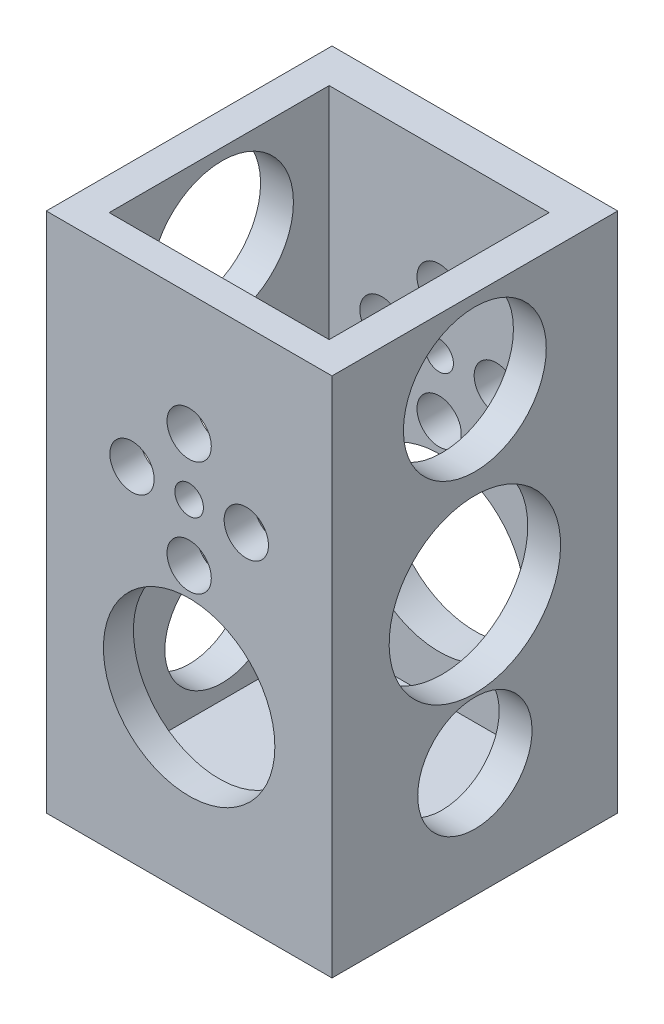
ISO-10303-21;
HEADER;
FILE_DESCRIPTION(('STEP AP214'),'2;1');
FILE_NAME('part.step','',(''),(''),'','','');
FILE_SCHEMA(('AUTOMOTIVE_DESIGN { 1 0 10303 214 1 1 1 1 }'));
ENDSEC;
DATA;
#1=APPLICATION_CONTEXT('core data for automotive mechanical design processes');
#2=APPLICATION_PROTOCOL_DEFINITION('international standard','automotive_design',2000,#1);
#3=PRODUCT_CONTEXT('',#1,'mechanical');
#4=PRODUCT('Part','Part','',(#3));
#5=PRODUCT_RELATED_PRODUCT_CATEGORY('part','',(#4));
#6=PRODUCT_DEFINITION_FORMATION('','',#4);
#7=PRODUCT_DEFINITION_CONTEXT('part definition',#1,'design');
#8=PRODUCT_DEFINITION('design','',#6,#7);
#9=PRODUCT_DEFINITION_SHAPE('','',#8);
#10=(LENGTH_UNIT() NAMED_UNIT(*) SI_UNIT(.MILLI.,.METRE.));
#11=(NAMED_UNIT(*) PLANE_ANGLE_UNIT() SI_UNIT($,.RADIAN.));
#12=(NAMED_UNIT(*) SI_UNIT($,.STERADIAN.) SOLID_ANGLE_UNIT());
#13=UNCERTAINTY_MEASURE_WITH_UNIT(LENGTH_MEASURE(1.E-05),#10,'distance_accuracy_value','');
#14=(GEOMETRIC_REPRESENTATION_CONTEXT(3) GLOBAL_UNCERTAINTY_ASSIGNED_CONTEXT((#13)) GLOBAL_UNIT_ASSIGNED_CONTEXT((#10,
#11,#12)) REPRESENTATION_CONTEXT('',''));
#15=CARTESIAN_POINT('',(0.,0.,0.));
#16=DIRECTION('',(0.,0.,1.));
#17=DIRECTION('',(1.,0.,0.));
#18=AXIS2_PLACEMENT_3D('',#15,#16,#17);
#19=CARTESIAN_POINT('',(0.,0.,20.));
#20=DIRECTION('',(0.,0.,-1.));
#21=DIRECTION('',(-1.,0.,0.));
#22=AXIS2_PLACEMENT_3D('',#19,#20,#21);
#23=CYLINDRICAL_SURFACE('',#22,1.);
#24=CARTESIAN_POINT('',(0.,0.,2.5));
#25=DIRECTION('',(0.,0.,-1.));
#26=DIRECTION('',(-1.,0.,0.));
#27=AXIS2_PLACEMENT_3D('',#24,#25,#26);
#28=CIRCLE('',#27,1.);
#29=CARTESIAN_POINT('',(-1.,0.,2.5));
#30=VERTEX_POINT('',#29);
#31=EDGE_CURVE('E177',#30,#30,#28,.T.);
#32=ORIENTED_EDGE('',*,*,#31,.F.);
#33=EDGE_LOOP('',(#32));
#34=FACE_BOUND('',#33,.T.);
#35=CARTESIAN_POINT('',(0.,0.,0.));
#36=DIRECTION('',(0.,0.,1.));
#37=DIRECTION('',(1.,0.,0.));
#38=AXIS2_PLACEMENT_3D('',#35,#36,#37);
#39=CIRCLE('',#38,1.);
#40=CARTESIAN_POINT('',(1.,0.,0.));
#41=VERTEX_POINT('',#40);
#42=EDGE_CURVE('E223',#41,#41,#39,.T.);
#43=ORIENTED_EDGE('',*,*,#42,.F.);
#44=EDGE_LOOP('',(#43));
#45=FACE_BOUND('',#44,.T.);
#46=ADVANCED_FACE('F36',(#34,#45),#23,.F.);
#47=CARTESIAN_POINT('',(0.,-11.9736496101837,20.));
#48=DIRECTION('',(0.,0.,-1.));
#49=DIRECTION('',(-1.,0.,0.));
#50=AXIS2_PLACEMENT_3D('',#47,#48,#49);
#51=CYLINDRICAL_SURFACE('',#50,6.);
#52=CARTESIAN_POINT('',(0.,-11.9736496101837,2.5));
#53=DIRECTION('',(0.,0.,-1.));
#54=DIRECTION('',(-1.,0.,0.));
#55=AXIS2_PLACEMENT_3D('',#52,#53,#54);
#56=CIRCLE('',#55,6.);
#57=CARTESIAN_POINT('',(-6.,-11.9736496101837,2.5));
#58=VERTEX_POINT('',#57);
#59=EDGE_CURVE('E174',#58,#58,#56,.T.);
#60=ORIENTED_EDGE('',*,*,#59,.F.);
#61=EDGE_LOOP('',(#60));
#62=FACE_BOUND('',#61,.T.);
#63=CARTESIAN_POINT('',(0.,-11.9736496101837,0.));
#64=DIRECTION('',(0.,0.,1.));
#65=DIRECTION('',(1.,0.,0.));
#66=AXIS2_PLACEMENT_3D('',#63,#64,#65);
#67=CIRCLE('',#66,6.);
#68=CARTESIAN_POINT('',(6.,-11.9736496101837,0.));
#69=VERTEX_POINT('',#68);
#70=EDGE_CURVE('E220',#69,#69,#67,.T.);
#71=ORIENTED_EDGE('',*,*,#70,.F.);
#72=EDGE_LOOP('',(#71));
#73=FACE_BOUND('',#72,.T.);
#74=ADVANCED_FACE('F314',(#62,#73),#51,.F.);
#75=CARTESIAN_POINT('',(0.,-4.,20.));
#76=DIRECTION('',(0.,0.,-1.));
#77=DIRECTION('',(-1.,0.,0.));
#78=AXIS2_PLACEMENT_3D('',#75,#76,#77);
#79=CYLINDRICAL_SURFACE('',#78,1.55);
#80=CARTESIAN_POINT('',(0.,-4.,2.5));
#81=DIRECTION('',(0.,0.,-1.));
#82=DIRECTION('',(-1.,0.,0.));
#83=AXIS2_PLACEMENT_3D('',#80,#81,#82);
#84=CIRCLE('',#83,1.55);
#85=CARTESIAN_POINT('',(-1.55,-4.,2.5));
#86=VERTEX_POINT('',#85);
#87=EDGE_CURVE('E171',#86,#86,#84,.T.);
#88=ORIENTED_EDGE('',*,*,#87,.F.);
#89=EDGE_LOOP('',(#88));
#90=FACE_BOUND('',#89,.T.);
#91=CARTESIAN_POINT('',(0.,-4.,0.));
#92=DIRECTION('',(0.,0.,1.));
#93=DIRECTION('',(1.,0.,0.));
#94=AXIS2_PLACEMENT_3D('',#91,#92,#93);
#95=CIRCLE('',#94,1.55);
#96=CARTESIAN_POINT('',(1.55,-4.,0.));
#97=VERTEX_POINT('',#96);
#98=EDGE_CURVE('E217',#97,#97,#95,.T.);
#99=ORIENTED_EDGE('',*,*,#98,.F.);
#100=EDGE_LOOP('',(#99));
#101=FACE_BOUND('',#100,.T.);
#102=ADVANCED_FACE('F321',(#90,#101),#79,.F.);
#103=CARTESIAN_POINT('',(4.,0.,20.));
#104=DIRECTION('',(0.,0.,-1.));
#105=DIRECTION('',(-1.,0.,0.));
#106=AXIS2_PLACEMENT_3D('',#103,#104,#105);
#107=CYLINDRICAL_SURFACE('',#106,1.55);
#108=CARTESIAN_POINT('',(4.,0.,2.5));
#109=DIRECTION('',(0.,0.,-1.));
#110=DIRECTION('',(-1.,0.,0.));
#111=AXIS2_PLACEMENT_3D('',#108,#109,#110);
#112=CIRCLE('',#111,1.55);
#113=CARTESIAN_POINT('',(2.45,0.,2.5));
#114=VERTEX_POINT('',#113);
#115=EDGE_CURVE('E168',#114,#114,#112,.T.);
#116=ORIENTED_EDGE('',*,*,#115,.F.);
#117=EDGE_LOOP('',(#116));
#118=FACE_BOUND('',#117,.T.);
#119=CARTESIAN_POINT('',(4.,0.,0.));
#120=DIRECTION('',(0.,0.,1.));
#121=DIRECTION('',(1.,0.,0.));
#122=AXIS2_PLACEMENT_3D('',#119,#120,#121);
#123=CIRCLE('',#122,1.55);
#124=CARTESIAN_POINT('',(5.55,0.,0.));
#125=VERTEX_POINT('',#124);
#126=EDGE_CURVE('E214',#125,#125,#123,.T.);
#127=ORIENTED_EDGE('',*,*,#126,.F.);
#128=EDGE_LOOP('',(#127));
#129=FACE_BOUND('',#128,.T.);
#130=ADVANCED_FACE('F375',(#118,#129),#107,.F.);
#131=CARTESIAN_POINT('',(0.,4.,20.));
#132=DIRECTION('',(0.,0.,-1.));
#133=DIRECTION('',(-1.,0.,0.));
#134=AXIS2_PLACEMENT_3D('',#131,#132,#133);
#135=CYLINDRICAL_SURFACE('',#134,1.55);
#136=CARTESIAN_POINT('',(0.,4.,2.5));
#137=DIRECTION('',(0.,0.,-1.));
#138=DIRECTION('',(-1.,0.,0.));
#139=AXIS2_PLACEMENT_3D('',#136,#137,#138);
#140=CIRCLE('',#139,1.55);
#141=CARTESIAN_POINT('',(-1.55,4.,2.5));
#142=VERTEX_POINT('',#141);
#143=EDGE_CURVE('E165',#142,#142,#140,.T.);
#144=ORIENTED_EDGE('',*,*,#143,.F.);
#145=EDGE_LOOP('',(#144));
#146=FACE_BOUND('',#145,.T.);
#147=CARTESIAN_POINT('',(0.,4.,0.));
#148=DIRECTION('',(0.,0.,1.));
#149=DIRECTION('',(1.,0.,0.));
#150=AXIS2_PLACEMENT_3D('',#147,#148,#149);
#151=CIRCLE('',#150,1.55);
#152=CARTESIAN_POINT('',(1.55,4.,0.));
#153=VERTEX_POINT('',#152);
#154=EDGE_CURVE('E211',#153,#153,#151,.T.);
#155=ORIENTED_EDGE('',*,*,#154,.F.);
#156=EDGE_LOOP('',(#155));
#157=FACE_BOUND('',#156,.T.);
#158=ADVANCED_FACE('F381',(#146,#157),#135,.F.);
#159=CARTESIAN_POINT('',(-4.,0.,20.));
#160=DIRECTION('',(0.,0.,-1.));
#161=DIRECTION('',(-1.,0.,0.));
#162=AXIS2_PLACEMENT_3D('',#159,#160,#161);
#163=CYLINDRICAL_SURFACE('',#162,1.55);
#164=CARTESIAN_POINT('',(-4.,0.,2.5));
#165=DIRECTION('',(0.,0.,-1.));
#166=DIRECTION('',(-1.,0.,0.));
#167=AXIS2_PLACEMENT_3D('',#164,#165,#166);
#168=CIRCLE('',#167,1.55);
#169=CARTESIAN_POINT('',(-5.55,0.,2.5));
#170=VERTEX_POINT('',#169);
#171=EDGE_CURVE('E164',#170,#170,#168,.T.);
#172=ORIENTED_EDGE('',*,*,#171,.F.);
#173=EDGE_LOOP('',(#172));
#174=FACE_BOUND('',#173,.T.);
#175=CARTESIAN_POINT('',(-4.,0.,0.));
#176=DIRECTION('',(0.,0.,1.));
#177=DIRECTION('',(1.,0.,0.));
#178=AXIS2_PLACEMENT_3D('',#175,#176,#177);
#179=CIRCLE('',#178,1.55);
#180=CARTESIAN_POINT('',(-2.45,0.,0.));
#181=VERTEX_POINT('',#180);
#182=EDGE_CURVE('E180',#181,#181,#179,.T.);
#183=ORIENTED_EDGE('',*,*,#182,.F.);
#184=EDGE_LOOP('',(#183));
#185=FACE_BOUND('',#184,.T.);
#186=ADVANCED_FACE('F309',(#174,#185),#163,.F.);
#187=CARTESIAN_POINT('',(0.,12.5,20.));
#188=DIRECTION('',(0.,1.,0.));
#189=DIRECTION('',(0.,0.,1.));
#190=AXIS2_PLACEMENT_3D('',#187,#188,#189);
#191=PLANE('',#190);
#192=DIRECTION('',(0.,0.,1.));
#193=VECTOR('',#192,1.);
#194=CARTESIAN_POINT('',(-7.7,12.5,10.2));
#195=LINE('',#194,#193);
#196=CARTESIAN_POINT('',(-7.7,12.5,2.5));
#197=VERTEX_POINT('',#196);
#198=CARTESIAN_POINT('',(-7.7,12.5,17.9));
#199=VERTEX_POINT('',#198);
#200=EDGE_CURVE('E112',#197,#199,#195,.T.);
#201=ORIENTED_EDGE('',*,*,#200,.F.);
#202=DIRECTION('',(-1.,0.,0.));
#203=VECTOR('',#202,1.);
#204=CARTESIAN_POINT('',(0.,12.5,2.5));
#205=LINE('',#204,#203);
#206=CARTESIAN_POINT('',(7.7,12.5,2.5));
#207=VERTEX_POINT('',#206);
#208=EDGE_CURVE('E128',#207,#197,#205,.T.);
#209=ORIENTED_EDGE('',*,*,#208,.F.);
#210=DIRECTION('',(0.,0.,-1.));
#211=VECTOR('',#210,1.);
#212=CARTESIAN_POINT('',(7.7,12.5,2.5));
#213=LINE('',#212,#211);
#214=CARTESIAN_POINT('',(7.7,12.5,17.9));
#215=VERTEX_POINT('',#214);
#216=EDGE_CURVE('E138',#215,#207,#213,.T.);
#217=ORIENTED_EDGE('',*,*,#216,.F.);
#218=DIRECTION('',(1.,0.,0.));
#219=VECTOR('',#218,1.);
#220=CARTESIAN_POINT('',(7.7,12.5,17.9));
#221=LINE('',#220,#219);
#222=EDGE_CURVE('E136',#199,#215,#221,.T.);
#223=ORIENTED_EDGE('',*,*,#222,.F.);
#224=EDGE_LOOP('',(#201,#209,#217,#223));
#225=FACE_BOUND('',#224,.T.);
#226=DIRECTION('',(1.,0.,0.));
#227=VECTOR('',#226,1.);
#228=CARTESIAN_POINT('',(0.,12.5,0.));
#229=LINE('',#228,#227);
#230=CARTESIAN_POINT('',(-10.,12.5,0.));
#231=VERTEX_POINT('',#230);
#232=CARTESIAN_POINT('',(10.,12.5,0.));
#233=VERTEX_POINT('',#232);
#234=EDGE_CURVE('E226',#231,#233,#229,.T.);
#235=ORIENTED_EDGE('',*,*,#234,.F.);
#236=DIRECTION('',(0.,0.,-1.));
#237=VECTOR('',#236,1.);
#238=CARTESIAN_POINT('',(-10.,12.5,20.));
#239=LINE('',#238,#237);
#240=CARTESIAN_POINT('',(-10.,12.5,20.));
#241=VERTEX_POINT('',#240);
#242=EDGE_CURVE('E11',#241,#231,#239,.T.);
#243=ORIENTED_EDGE('',*,*,#242,.F.);
#244=DIRECTION('',(1.,0.,0.));
#245=VECTOR('',#244,1.);
#246=CARTESIAN_POINT('',(0.,12.5,20.));
#247=LINE('',#246,#245);
#248=CARTESIAN_POINT('',(10.,12.5,20.));
#249=VERTEX_POINT('',#248);
#250=EDGE_CURVE('E200',#241,#249,#247,.T.);
#251=ORIENTED_EDGE('',*,*,#250,.T.);
#252=DIRECTION('',(0.,0.,-1.));
#253=VECTOR('',#252,1.);
#254=CARTESIAN_POINT('',(10.,12.5,20.));
#255=LINE('',#254,#253);
#256=EDGE_CURVE('E62',#249,#233,#255,.T.);
#257=ORIENTED_EDGE('',*,*,#256,.T.);
#258=EDGE_LOOP('',(#235,#243,#251,#257));
#259=FACE_BOUND('',#258,.T.);
#260=ADVANCED_FACE('F284',(#225,#259),#191,.T.);
#261=CARTESIAN_POINT('',(-10.,0.,20.));
#262=DIRECTION('',(1.,0.,0.));
#263=DIRECTION('',(0.,1.,0.));
#264=AXIS2_PLACEMENT_3D('',#261,#262,#263);
#265=PLANE('',#264);
#266=CARTESIAN_POINT('',(-10.,6.68809755927668,10.));
#267=DIRECTION('',(-1.,0.,0.));
#268=DIRECTION('',(0.,-1.,0.));
#269=AXIS2_PLACEMENT_3D('',#266,#267,#268);
#270=CIRCLE('',#269,5.);
#271=CARTESIAN_POINT('',(-10.,1.68809755927668,10.));
#272=VERTEX_POINT('',#271);
#273=EDGE_CURVE('E256',#272,#272,#270,.T.);
#274=ORIENTED_EDGE('',*,*,#273,.F.);
#275=EDGE_LOOP('',(#274));
#276=FACE_BOUND('',#275,.T.);
#277=CARTESIAN_POINT('',(-10.,-15.9730883265574,10.));
#278=DIRECTION('',(-1.,0.,0.));
#279=DIRECTION('',(0.,-1.,0.));
#280=AXIS2_PLACEMENT_3D('',#277,#278,#279);
#281=CIRCLE('',#280,4.);
#282=CARTESIAN_POINT('',(-10.,-19.9730883265574,10.));
#283=VERTEX_POINT('',#282);
#284=EDGE_CURVE('E266',#283,#283,#281,.T.);
#285=ORIENTED_EDGE('',*,*,#284,.F.);
#286=EDGE_LOOP('',(#285));
#287=FACE_BOUND('',#286,.T.);
#288=CARTESIAN_POINT('',(-10.,-5.75000000000001,10.));
#289=DIRECTION('',(-1.,0.,0.));
#290=DIRECTION('',(0.,-1.,0.));
#291=AXIS2_PLACEMENT_3D('',#288,#289,#290);
#292=CIRCLE('',#291,6.);
#293=CARTESIAN_POINT('',(-10.,-11.75,10.));
#294=VERTEX_POINT('',#293);
#295=EDGE_CURVE('E272',#294,#294,#292,.T.);
#296=ORIENTED_EDGE('',*,*,#295,.F.);
#297=EDGE_LOOP('',(#296));
#298=FACE_BOUND('',#297,.T.);
#299=DIRECTION('',(0.,-1.,0.));
#300=VECTOR('',#299,1.);
#301=CARTESIAN_POINT('',(-10.,0.,0.));
#302=LINE('',#301,#300);
#303=CARTESIAN_POINT('',(-9.99999999999999,-24.,0.));
#304=VERTEX_POINT('',#303);
#305=EDGE_CURVE('E228',#231,#304,#302,.T.);
#306=ORIENTED_EDGE('',*,*,#305,.T.);
#307=DIRECTION('',(0.,0.,-1.));
#308=VECTOR('',#307,1.);
#309=CARTESIAN_POINT('',(-9.99999999999999,-24.,20.));
#310=LINE('',#309,#308);
#311=CARTESIAN_POINT('',(-9.99999999999999,-24.,20.));
#312=VERTEX_POINT('',#311);
#313=EDGE_CURVE('E45',#312,#304,#310,.T.);
#314=ORIENTED_EDGE('',*,*,#313,.F.);
#315=DIRECTION('',(0.,-1.,0.));
#316=VECTOR('',#315,1.);
#317=CARTESIAN_POINT('',(-10.,0.,20.));
#318=LINE('',#317,#316);
#319=EDGE_CURVE('E202',#241,#312,#318,.T.);
#320=ORIENTED_EDGE('',*,*,#319,.F.);
#321=ORIENTED_EDGE('',*,*,#242,.T.);
#322=EDGE_LOOP('',(#306,#314,#320,#321));
#323=FACE_BOUND('',#322,.T.);
#324=ADVANCED_FACE('F280',(#276,#287,#298,#323),#265,.F.);
#325=CARTESIAN_POINT('',(0.,-24.,20.));
#326=DIRECTION('',(0.,-1.,0.));
#327=DIRECTION('',(1.,0.,0.));
#328=AXIS2_PLACEMENT_3D('',#325,#326,#327);
#329=PLANE('',#328);
#330=DIRECTION('',(-1.,0.,0.));
#331=VECTOR('',#330,1.);
#332=CARTESIAN_POINT('',(0.,-24.,0.));
#333=LINE('',#332,#331);
#334=CARTESIAN_POINT('',(10.,-24.,0.));
#335=VERTEX_POINT('',#334);
#336=EDGE_CURVE('E231',#335,#304,#333,.T.);
#337=ORIENTED_EDGE('',*,*,#336,.F.);
#338=DIRECTION('',(0.,0.,-1.));
#339=VECTOR('',#338,1.);
#340=CARTESIAN_POINT('',(10.,-24.,20.));
#341=LINE('',#340,#339);
#342=CARTESIAN_POINT('',(10.,-24.,20.));
#343=VERTEX_POINT('',#342);
#344=EDGE_CURVE('E237',#343,#335,#341,.T.);
#345=ORIENTED_EDGE('',*,*,#344,.F.);
#346=DIRECTION('',(-1.,0.,0.));
#347=VECTOR('',#346,1.);
#348=CARTESIAN_POINT('',(0.,-24.,20.));
#349=LINE('',#348,#347);
#350=EDGE_CURVE('E204',#343,#312,#349,.T.);
#351=ORIENTED_EDGE('',*,*,#350,.T.);
#352=ORIENTED_EDGE('',*,*,#313,.T.);
#353=EDGE_LOOP('',(#337,#345,#351,#352));
#354=FACE_BOUND('',#353,.T.);
#355=ADVANCED_FACE('F283',(#354),#329,.T.);
#356=CARTESIAN_POINT('',(0.,0.,17.9));
#357=DIRECTION('',(0.,0.,1.));
#358=DIRECTION('',(1.,0.,0.));
#359=AXIS2_PLACEMENT_3D('',#356,#357,#358);
#360=CIRCLE('',#359,1.);
#361=CARTESIAN_POINT('',(1.,0.,17.9));
#362=VERTEX_POINT('',#361);
#363=EDGE_CURVE('E161',#362,#362,#360,.T.);
#364=ORIENTED_EDGE('',*,*,#363,.F.);
#365=EDGE_LOOP('',(#364));
#366=FACE_BOUND('',#365,.T.);
#367=CARTESIAN_POINT('',(0.,0.,20.));
#368=DIRECTION('',(0.,0.,1.));
#369=DIRECTION('',(1.,0.,0.));
#370=AXIS2_PLACEMENT_3D('',#367,#368,#369);
#371=CIRCLE('',#370,1.);
#372=CARTESIAN_POINT('',(1.,0.,20.));
#373=VERTEX_POINT('',#372);
#374=EDGE_CURVE('E197',#373,#373,#371,.T.);
#375=ORIENTED_EDGE('',*,*,#374,.T.);
#376=EDGE_LOOP('',(#375));
#377=FACE_BOUND('',#376,.T.);
#378=ADVANCED_FACE('F317',(#366,#377),#23,.F.);
#379=CARTESIAN_POINT('',(0.,-11.9736496101837,17.9));
#380=DIRECTION('',(0.,0.,1.));
#381=DIRECTION('',(1.,0.,0.));
#382=AXIS2_PLACEMENT_3D('',#379,#380,#381);
#383=CIRCLE('',#382,6.);
#384=CARTESIAN_POINT('',(6.,-11.9736496101837,17.9));
#385=VERTEX_POINT('',#384);
#386=EDGE_CURVE('E158',#385,#385,#383,.T.);
#387=ORIENTED_EDGE('',*,*,#386,.F.);
#388=EDGE_LOOP('',(#387));
#389=FACE_BOUND('',#388,.T.);
#390=CARTESIAN_POINT('',(0.,-11.9736496101837,20.));
#391=DIRECTION('',(0.,0.,1.));
#392=DIRECTION('',(1.,0.,0.));
#393=AXIS2_PLACEMENT_3D('',#390,#391,#392);
#394=CIRCLE('',#393,6.);
#395=CARTESIAN_POINT('',(6.,-11.9736496101837,20.));
#396=VERTEX_POINT('',#395);
#397=EDGE_CURVE('E194',#396,#396,#394,.T.);
#398=ORIENTED_EDGE('',*,*,#397,.T.);
#399=EDGE_LOOP('',(#398));
#400=FACE_BOUND('',#399,.T.);
#401=ADVANCED_FACE('F324',(#389,#400),#51,.F.);
#402=CARTESIAN_POINT('',(0.,-4.,17.9));
#403=DIRECTION('',(0.,0.,1.));
#404=DIRECTION('',(1.,0.,0.));
#405=AXIS2_PLACEMENT_3D('',#402,#403,#404);
#406=CIRCLE('',#405,1.55);
#407=CARTESIAN_POINT('',(1.55,-4.,17.9));
#408=VERTEX_POINT('',#407);
#409=EDGE_CURVE('E155',#408,#408,#406,.T.);
#410=ORIENTED_EDGE('',*,*,#409,.F.);
#411=EDGE_LOOP('',(#410));
#412=FACE_BOUND('',#411,.T.);
#413=CARTESIAN_POINT('',(0.,-4.,20.));
#414=DIRECTION('',(0.,0.,1.));
#415=DIRECTION('',(1.,0.,0.));
#416=AXIS2_PLACEMENT_3D('',#413,#414,#415);
#417=CIRCLE('',#416,1.55);
#418=CARTESIAN_POINT('',(1.55,-4.,20.));
#419=VERTEX_POINT('',#418);
#420=EDGE_CURVE('E191',#419,#419,#417,.T.);
#421=ORIENTED_EDGE('',*,*,#420,.T.);
#422=EDGE_LOOP('',(#421));
#423=FACE_BOUND('',#422,.T.);
#424=ADVANCED_FACE('F334',(#412,#423),#79,.F.);
#425=CARTESIAN_POINT('',(4.,0.,17.9));
#426=DIRECTION('',(0.,0.,1.));
#427=DIRECTION('',(1.,0.,0.));
#428=AXIS2_PLACEMENT_3D('',#425,#426,#427);
#429=CIRCLE('',#428,1.55);
#430=CARTESIAN_POINT('',(5.55,0.,17.9));
#431=VERTEX_POINT('',#430);
#432=EDGE_CURVE('E152',#431,#431,#429,.T.);
#433=ORIENTED_EDGE('',*,*,#432,.F.);
#434=EDGE_LOOP('',(#433));
#435=FACE_BOUND('',#434,.T.);
#436=CARTESIAN_POINT('',(4.,0.,20.));
#437=DIRECTION('',(0.,0.,1.));
#438=DIRECTION('',(1.,0.,0.));
#439=AXIS2_PLACEMENT_3D('',#436,#437,#438);
#440=CIRCLE('',#439,1.55);
#441=CARTESIAN_POINT('',(5.55,0.,20.));
#442=VERTEX_POINT('',#441);
#443=EDGE_CURVE('E188',#442,#442,#440,.T.);
#444=ORIENTED_EDGE('',*,*,#443,.T.);
#445=EDGE_LOOP('',(#444));
#446=FACE_BOUND('',#445,.T.);
#447=ADVANCED_FACE('F367',(#435,#446),#107,.F.);
#448=CARTESIAN_POINT('',(0.,4.,17.9));
#449=DIRECTION('',(0.,0.,1.));
#450=DIRECTION('',(1.,0.,0.));
#451=AXIS2_PLACEMENT_3D('',#448,#449,#450);
#452=CIRCLE('',#451,1.55);
#453=CARTESIAN_POINT('',(1.55,4.,17.9));
#454=VERTEX_POINT('',#453);
#455=EDGE_CURVE('E149',#454,#454,#452,.T.);
#456=ORIENTED_EDGE('',*,*,#455,.F.);
#457=EDGE_LOOP('',(#456));
#458=FACE_BOUND('',#457,.T.);
#459=CARTESIAN_POINT('',(0.,4.,20.));
#460=DIRECTION('',(0.,0.,1.));
#461=DIRECTION('',(1.,0.,0.));
#462=AXIS2_PLACEMENT_3D('',#459,#460,#461);
#463=CIRCLE('',#462,1.55);
#464=CARTESIAN_POINT('',(1.55,4.,20.));
#465=VERTEX_POINT('',#464);
#466=EDGE_CURVE('E184',#465,#465,#463,.T.);
#467=ORIENTED_EDGE('',*,*,#466,.T.);
#468=EDGE_LOOP('',(#467));
#469=FACE_BOUND('',#468,.T.);
#470=ADVANCED_FACE('F307',(#458,#469),#135,.F.);
#471=CARTESIAN_POINT('',(-4.,0.,17.9));
#472=DIRECTION('',(0.,0.,1.));
#473=DIRECTION('',(1.,0.,0.));
#474=AXIS2_PLACEMENT_3D('',#471,#472,#473);
#475=CIRCLE('',#474,1.55);
#476=CARTESIAN_POINT('',(-2.45,0.,17.9));
#477=VERTEX_POINT('',#476);
#478=EDGE_CURVE('E145',#477,#477,#475,.T.);
#479=ORIENTED_EDGE('',*,*,#478,.F.);
#480=EDGE_LOOP('',(#479));
#481=FACE_BOUND('',#480,.T.);
#482=CARTESIAN_POINT('',(-4.,0.,20.));
#483=DIRECTION('',(0.,0.,1.));
#484=DIRECTION('',(1.,0.,0.));
#485=AXIS2_PLACEMENT_3D('',#482,#483,#484);
#486=CIRCLE('',#485,1.55);
#487=CARTESIAN_POINT('',(-2.45,0.,20.));
#488=VERTEX_POINT('',#487);
#489=EDGE_CURVE('E181',#488,#488,#486,.T.);
#490=ORIENTED_EDGE('',*,*,#489,.T.);
#491=EDGE_LOOP('',(#490));
#492=FACE_BOUND('',#491,.T.);
#493=ADVANCED_FACE('F38',(#481,#492),#163,.F.);
#494=CARTESIAN_POINT('',(10.,0.,20.));
#495=DIRECTION('',(1.,0.,0.));
#496=DIRECTION('',(0.,1.,0.));
#497=AXIS2_PLACEMENT_3D('',#494,#495,#496);
#498=PLANE('',#497);
#499=CARTESIAN_POINT('',(10.,6.68809755927669,10.));
#500=DIRECTION('',(-1.,0.,0.));
#501=DIRECTION('',(0.,-1.,0.));
#502=AXIS2_PLACEMENT_3D('',#499,#500,#501);
#503=CIRCLE('',#502,5.);
#504=CARTESIAN_POINT('',(10.,1.68809755927669,10.));
#505=VERTEX_POINT('',#504);
#506=EDGE_CURVE('E250',#505,#505,#503,.T.);
#507=ORIENTED_EDGE('',*,*,#506,.T.);
#508=EDGE_LOOP('',(#507));
#509=FACE_BOUND('',#508,.T.);
#510=CARTESIAN_POINT('',(10.,-15.9730883265574,10.));
#511=DIRECTION('',(-1.,0.,0.));
#512=DIRECTION('',(0.,-1.,0.));
#513=AXIS2_PLACEMENT_3D('',#510,#511,#512);
#514=CIRCLE('',#513,4.);
#515=CARTESIAN_POINT('',(10.,-19.9730883265574,10.));
#516=VERTEX_POINT('',#515);
#517=EDGE_CURVE('E261',#516,#516,#514,.T.);
#518=ORIENTED_EDGE('',*,*,#517,.T.);
#519=EDGE_LOOP('',(#518));
#520=FACE_BOUND('',#519,.T.);
#521=CARTESIAN_POINT('',(10.,-5.75000000000001,10.));
#522=DIRECTION('',(-1.,0.,0.));
#523=DIRECTION('',(0.,-1.,0.));
#524=AXIS2_PLACEMENT_3D('',#521,#522,#523);
#525=CIRCLE('',#524,6.);
#526=CARTESIAN_POINT('',(10.,-11.75,10.));
#527=VERTEX_POINT('',#526);
#528=EDGE_CURVE('E246',#527,#527,#525,.T.);
#529=ORIENTED_EDGE('',*,*,#528,.T.);
#530=EDGE_LOOP('',(#529));
#531=FACE_BOUND('',#530,.T.);
#532=DIRECTION('',(0.,-1.,0.));
#533=VECTOR('',#532,1.);
#534=CARTESIAN_POINT('',(10.,0.,0.));
#535=LINE('',#534,#533);
#536=EDGE_CURVE('E185',#233,#335,#535,.T.);
#537=ORIENTED_EDGE('',*,*,#536,.F.);
#538=ORIENTED_EDGE('',*,*,#256,.F.);
#539=DIRECTION('',(0.,-1.,0.));
#540=VECTOR('',#539,1.);
#541=CARTESIAN_POINT('',(10.,0.,20.));
#542=LINE('',#541,#540);
#543=EDGE_CURVE('E207',#249,#343,#542,.T.);
#544=ORIENTED_EDGE('',*,*,#543,.T.);
#545=ORIENTED_EDGE('',*,*,#344,.T.);
#546=EDGE_LOOP('',(#537,#538,#544,#545));
#547=FACE_BOUND('',#546,.T.);
#548=ADVANCED_FACE('F298',(#509,#520,#531,#547),#498,.T.);
#549=CARTESIAN_POINT('',(0.,0.,20.));
#550=DIRECTION('',(0.,0.,1.));
#551=DIRECTION('',(1.,0.,0.));
#552=AXIS2_PLACEMENT_3D('',#549,#550,#551);
#553=PLANE('',#552);
#554=ORIENTED_EDGE('',*,*,#489,.F.);
#555=EDGE_LOOP('',(#554));
#556=FACE_BOUND('',#555,.T.);
#557=ORIENTED_EDGE('',*,*,#466,.F.);
#558=EDGE_LOOP('',(#557));
#559=FACE_BOUND('',#558,.T.);
#560=ORIENTED_EDGE('',*,*,#443,.F.);
#561=EDGE_LOOP('',(#560));
#562=FACE_BOUND('',#561,.T.);
#563=ORIENTED_EDGE('',*,*,#420,.F.);
#564=EDGE_LOOP('',(#563));
#565=FACE_BOUND('',#564,.T.);
#566=ORIENTED_EDGE('',*,*,#397,.F.);
#567=EDGE_LOOP('',(#566));
#568=FACE_BOUND('',#567,.T.);
#569=ORIENTED_EDGE('',*,*,#374,.F.);
#570=EDGE_LOOP('',(#569));
#571=FACE_BOUND('',#570,.T.);
#572=ORIENTED_EDGE('',*,*,#250,.F.);
#573=ORIENTED_EDGE('',*,*,#319,.T.);
#574=ORIENTED_EDGE('',*,*,#350,.F.);
#575=ORIENTED_EDGE('',*,*,#543,.F.);
#576=EDGE_LOOP('',(#572,#573,#574,#575));
#577=FACE_BOUND('',#576,.T.);
#578=ADVANCED_FACE('F297',(#556,#559,#562,#565,#568,#571,#577),#553,.T.);
#579=CARTESIAN_POINT('',(0.,0.,0.));
#580=DIRECTION('',(0.,0.,1.));
#581=DIRECTION('',(1.,0.,0.));
#582=AXIS2_PLACEMENT_3D('',#579,#580,#581);
#583=PLANE('',#582);
#584=ORIENTED_EDGE('',*,*,#182,.T.);
#585=EDGE_LOOP('',(#584));
#586=FACE_BOUND('',#585,.T.);
#587=ORIENTED_EDGE('',*,*,#154,.T.);
#588=EDGE_LOOP('',(#587));
#589=FACE_BOUND('',#588,.T.);
#590=ORIENTED_EDGE('',*,*,#126,.T.);
#591=EDGE_LOOP('',(#590));
#592=FACE_BOUND('',#591,.T.);
#593=ORIENTED_EDGE('',*,*,#98,.T.);
#594=EDGE_LOOP('',(#593));
#595=FACE_BOUND('',#594,.T.);
#596=ORIENTED_EDGE('',*,*,#70,.T.);
#597=EDGE_LOOP('',(#596));
#598=FACE_BOUND('',#597,.T.);
#599=ORIENTED_EDGE('',*,*,#42,.T.);
#600=EDGE_LOOP('',(#599));
#601=FACE_BOUND('',#600,.T.);
#602=ORIENTED_EDGE('',*,*,#234,.T.);
#603=ORIENTED_EDGE('',*,*,#536,.T.);
#604=ORIENTED_EDGE('',*,*,#336,.T.);
#605=ORIENTED_EDGE('',*,*,#305,.F.);
#606=EDGE_LOOP('',(#602,#603,#604,#605));
#607=FACE_BOUND('',#606,.T.);
#608=ADVANCED_FACE('F291',(#586,#589,#592,#595,#598,#601,#607),#583,.F.);
#609=CARTESIAN_POINT('',(-7.7,-21.,10.2));
#610=DIRECTION('',(-1.,0.,0.));
#611=DIRECTION('',(0.,0.,1.));
#612=AXIS2_PLACEMENT_3D('',#609,#610,#611);
#613=PLANE('',#612);
#614=CARTESIAN_POINT('',(-7.69999999999999,6.68809755927668,10.));
#615=DIRECTION('',(-1.,0.,0.));
#616=DIRECTION('',(0.,0.,1.));
#617=AXIS2_PLACEMENT_3D('',#614,#615,#616);
#618=CIRCLE('',#617,5.);
#619=CARTESIAN_POINT('',(-7.69999999999999,6.68809755927668,15.));
#620=VERTEX_POINT('',#619);
#621=EDGE_CURVE('E269',#620,#620,#618,.T.);
#622=ORIENTED_EDGE('',*,*,#621,.T.);
#623=EDGE_LOOP('',(#622));
#624=FACE_BOUND('',#623,.T.);
#625=CARTESIAN_POINT('',(-7.7,-15.9730883265574,10.));
#626=DIRECTION('',(-1.,0.,0.));
#627=DIRECTION('',(0.,0.,1.));
#628=AXIS2_PLACEMENT_3D('',#625,#626,#627);
#629=CIRCLE('',#628,4.);
#630=CARTESIAN_POINT('',(-7.7,-15.9730883265574,14.));
#631=VERTEX_POINT('',#630);
#632=EDGE_CURVE('E249',#631,#631,#629,.T.);
#633=ORIENTED_EDGE('',*,*,#632,.T.);
#634=EDGE_LOOP('',(#633));
#635=FACE_BOUND('',#634,.T.);
#636=CARTESIAN_POINT('',(-7.7,-5.75000000000001,10.));
#637=DIRECTION('',(-1.,0.,0.));
#638=DIRECTION('',(0.,0.,1.));
#639=AXIS2_PLACEMENT_3D('',#636,#637,#638);
#640=CIRCLE('',#639,6.);
#641=CARTESIAN_POINT('',(-7.7,-5.75000000000001,16.));
#642=VERTEX_POINT('',#641);
#643=EDGE_CURVE('E131',#642,#642,#640,.T.);
#644=ORIENTED_EDGE('',*,*,#643,.T.);
#645=EDGE_LOOP('',(#644));
#646=FACE_BOUND('',#645,.T.);
#647=ORIENTED_EDGE('',*,*,#200,.T.);
#648=DIRECTION('',(0.,1.,0.));
#649=VECTOR('',#648,1.);
#650=CARTESIAN_POINT('',(-7.7,-21.,17.9));
#651=LINE('',#650,#649);
#652=CARTESIAN_POINT('',(-7.7,-21.,17.9));
#653=VERTEX_POINT('',#652);
#654=EDGE_CURVE('E53',#653,#199,#651,.T.);
#655=ORIENTED_EDGE('',*,*,#654,.F.);
#656=DIRECTION('',(0.,0.,1.));
#657=VECTOR('',#656,1.);
#658=CARTESIAN_POINT('',(-7.7,-21.,10.2));
#659=LINE('',#658,#657);
#660=CARTESIAN_POINT('',(-7.7,-21.,2.5));
#661=VERTEX_POINT('',#660);
#662=EDGE_CURVE('E109',#661,#653,#659,.T.);
#663=ORIENTED_EDGE('',*,*,#662,.F.);
#664=DIRECTION('',(0.,1.,0.));
#665=VECTOR('',#664,1.);
#666=CARTESIAN_POINT('',(-7.7,-21.,2.5));
#667=LINE('',#666,#665);
#668=EDGE_CURVE('E143',#661,#197,#667,.T.);
#669=ORIENTED_EDGE('',*,*,#668,.T.);
#670=EDGE_LOOP('',(#647,#655,#663,#669));
#671=FACE_BOUND('',#670,.T.);
#672=ADVANCED_FACE('F107',(#624,#635,#646,#671),#613,.F.);
#673=CARTESIAN_POINT('',(0.,-21.,2.5));
#674=DIRECTION('',(0.,0.,-1.));
#675=DIRECTION('',(-1.,0.,0.));
#676=AXIS2_PLACEMENT_3D('',#673,#674,#675);
#677=PLANE('',#676);
#678=ORIENTED_EDGE('',*,*,#31,.T.);
#679=EDGE_LOOP('',(#678));
#680=FACE_BOUND('',#679,.T.);
#681=ORIENTED_EDGE('',*,*,#59,.T.);
#682=EDGE_LOOP('',(#681));
#683=FACE_BOUND('',#682,.T.);
#684=ORIENTED_EDGE('',*,*,#87,.T.);
#685=EDGE_LOOP('',(#684));
#686=FACE_BOUND('',#685,.T.);
#687=ORIENTED_EDGE('',*,*,#115,.T.);
#688=EDGE_LOOP('',(#687));
#689=FACE_BOUND('',#688,.T.);
#690=ORIENTED_EDGE('',*,*,#143,.T.);
#691=EDGE_LOOP('',(#690));
#692=FACE_BOUND('',#691,.T.);
#693=ORIENTED_EDGE('',*,*,#171,.T.);
#694=EDGE_LOOP('',(#693));
#695=FACE_BOUND('',#694,.T.);
#696=ORIENTED_EDGE('',*,*,#208,.T.);
#697=ORIENTED_EDGE('',*,*,#668,.F.);
#698=DIRECTION('',(-1.,0.,0.));
#699=VECTOR('',#698,1.);
#700=CARTESIAN_POINT('',(0.,-21.,2.5));
#701=LINE('',#700,#699);
#702=CARTESIAN_POINT('',(7.7,-21.,2.5));
#703=VERTEX_POINT('',#702);
#704=EDGE_CURVE('E115',#703,#661,#701,.T.);
#705=ORIENTED_EDGE('',*,*,#704,.F.);
#706=DIRECTION('',(0.,1.,0.));
#707=VECTOR('',#706,1.);
#708=CARTESIAN_POINT('',(7.7,-21.,2.5));
#709=LINE('',#708,#707);
#710=EDGE_CURVE('E146',#703,#207,#709,.T.);
#711=ORIENTED_EDGE('',*,*,#710,.T.);
#712=EDGE_LOOP('',(#696,#697,#705,#711));
#713=FACE_BOUND('',#712,.T.);
#714=ADVANCED_FACE('F397',(#680,#683,#686,#689,#692,#695,#713),#677,.F.);
#715=CARTESIAN_POINT('',(7.7,-21.,2.5));
#716=DIRECTION('',(1.,0.,0.));
#717=DIRECTION('',(0.,0.,-1.));
#718=AXIS2_PLACEMENT_3D('',#715,#716,#717);
#719=PLANE('',#718);
#720=CARTESIAN_POINT('',(7.7,6.68809755927669,10.));
#721=DIRECTION('',(1.,0.,0.));
#722=DIRECTION('',(0.,0.,-1.));
#723=AXIS2_PLACEMENT_3D('',#720,#721,#722);
#724=CIRCLE('',#723,5.);
#725=CARTESIAN_POINT('',(7.7,6.68809755927669,5.));
#726=VERTEX_POINT('',#725);
#727=EDGE_CURVE('E40',#726,#726,#724,.T.);
#728=ORIENTED_EDGE('',*,*,#727,.T.);
#729=EDGE_LOOP('',(#728));
#730=FACE_BOUND('',#729,.T.);
#731=CARTESIAN_POINT('',(7.7,-15.9730883265574,10.));
#732=DIRECTION('',(1.,0.,0.));
#733=DIRECTION('',(0.,0.,-1.));
#734=AXIS2_PLACEMENT_3D('',#731,#732,#733);
#735=CIRCLE('',#734,4.);
#736=CARTESIAN_POINT('',(7.7,-15.9730883265574,6.));
#737=VERTEX_POINT('',#736);
#738=EDGE_CURVE('E247',#737,#737,#735,.T.);
#739=ORIENTED_EDGE('',*,*,#738,.T.);
#740=EDGE_LOOP('',(#739));
#741=FACE_BOUND('',#740,.T.);
#742=CARTESIAN_POINT('',(7.7,-5.75000000000001,10.));
#743=DIRECTION('',(1.,0.,0.));
#744=DIRECTION('',(0.,0.,-1.));
#745=AXIS2_PLACEMENT_3D('',#742,#743,#744);
#746=CIRCLE('',#745,6.);
#747=CARTESIAN_POINT('',(7.7,-5.75000000000001,4.));
#748=VERTEX_POINT('',#747);
#749=EDGE_CURVE('E244',#748,#748,#746,.T.);
#750=ORIENTED_EDGE('',*,*,#749,.T.);
#751=EDGE_LOOP('',(#750));
#752=FACE_BOUND('',#751,.T.);
#753=ORIENTED_EDGE('',*,*,#216,.T.);
#754=ORIENTED_EDGE('',*,*,#710,.F.);
#755=DIRECTION('',(0.,0.,-1.));
#756=VECTOR('',#755,1.);
#757=CARTESIAN_POINT('',(7.7,-21.,2.5));
#758=LINE('',#757,#756);
#759=CARTESIAN_POINT('',(7.7,-21.,17.9));
#760=VERTEX_POINT('',#759);
#761=EDGE_CURVE('E123',#760,#703,#758,.T.);
#762=ORIENTED_EDGE('',*,*,#761,.F.);
#763=DIRECTION('',(0.,1.,0.));
#764=VECTOR('',#763,1.);
#765=CARTESIAN_POINT('',(7.7,-21.,17.9));
#766=LINE('',#765,#764);
#767=EDGE_CURVE('E114',#760,#215,#766,.T.);
#768=ORIENTED_EDGE('',*,*,#767,.T.);
#769=EDGE_LOOP('',(#753,#754,#762,#768));
#770=FACE_BOUND('',#769,.T.);
#771=ADVANCED_FACE('F343',(#730,#741,#752,#770),#719,.F.);
#772=CARTESIAN_POINT('',(7.7,-21.,17.9));
#773=DIRECTION('',(0.,0.,1.));
#774=DIRECTION('',(1.,0.,0.));
#775=AXIS2_PLACEMENT_3D('',#772,#773,#774);
#776=PLANE('',#775);
#777=ORIENTED_EDGE('',*,*,#363,.T.);
#778=EDGE_LOOP('',(#777));
#779=FACE_BOUND('',#778,.T.);
#780=ORIENTED_EDGE('',*,*,#386,.T.);
#781=EDGE_LOOP('',(#780));
#782=FACE_BOUND('',#781,.T.);
#783=ORIENTED_EDGE('',*,*,#409,.T.);
#784=EDGE_LOOP('',(#783));
#785=FACE_BOUND('',#784,.T.);
#786=ORIENTED_EDGE('',*,*,#432,.T.);
#787=EDGE_LOOP('',(#786));
#788=FACE_BOUND('',#787,.T.);
#789=ORIENTED_EDGE('',*,*,#455,.T.);
#790=EDGE_LOOP('',(#789));
#791=FACE_BOUND('',#790,.T.);
#792=ORIENTED_EDGE('',*,*,#478,.T.);
#793=EDGE_LOOP('',(#792));
#794=FACE_BOUND('',#793,.T.);
#795=ORIENTED_EDGE('',*,*,#222,.T.);
#796=ORIENTED_EDGE('',*,*,#767,.F.);
#797=DIRECTION('',(1.,0.,0.));
#798=VECTOR('',#797,1.);
#799=CARTESIAN_POINT('',(0.,-21.,17.9));
#800=LINE('',#799,#798);
#801=EDGE_CURVE('E118',#653,#760,#800,.T.);
#802=ORIENTED_EDGE('',*,*,#801,.F.);
#803=ORIENTED_EDGE('',*,*,#654,.T.);
#804=EDGE_LOOP('',(#795,#796,#802,#803));
#805=FACE_BOUND('',#804,.T.);
#806=ADVANCED_FACE('F119',(#779,#782,#785,#788,#791,#794,#805),#776,.F.);
#807=CARTESIAN_POINT('',(0.,-21.,0.));
#808=DIRECTION('',(0.,-1.,0.));
#809=DIRECTION('',(0.,0.,-1.));
#810=AXIS2_PLACEMENT_3D('',#807,#808,#809);
#811=PLANE('',#810);
#812=ORIENTED_EDGE('',*,*,#662,.T.);
#813=ORIENTED_EDGE('',*,*,#801,.T.);
#814=ORIENTED_EDGE('',*,*,#761,.T.);
#815=ORIENTED_EDGE('',*,*,#704,.T.);
#816=EDGE_LOOP('',(#812,#813,#814,#815));
#817=FACE_BOUND('',#816,.T.);
#818=ADVANCED_FACE('F125',(#817),#811,.F.);
#819=CARTESIAN_POINT('',(10.,-5.75000000000001,10.));
#820=DIRECTION('',(-1.,0.,0.));
#821=DIRECTION('',(0.,-1.,0.));
#822=AXIS2_PLACEMENT_3D('',#819,#820,#821);
#823=CYLINDRICAL_SURFACE('',#822,6.);
#824=ORIENTED_EDGE('',*,*,#528,.F.);
#825=EDGE_LOOP('',(#824));
#826=FACE_BOUND('',#825,.T.);
#827=ORIENTED_EDGE('',*,*,#749,.F.);
#828=EDGE_LOOP('',(#827));
#829=FACE_BOUND('',#828,.T.);
#830=ADVANCED_FACE('F410',(#826,#829),#823,.F.);
#831=ORIENTED_EDGE('',*,*,#295,.T.);
#832=EDGE_LOOP('',(#831));
#833=FACE_BOUND('',#832,.T.);
#834=ORIENTED_EDGE('',*,*,#643,.F.);
#835=EDGE_LOOP('',(#834));
#836=FACE_BOUND('',#835,.T.);
#837=ADVANCED_FACE('F277',(#833,#836),#823,.F.);
#838=CARTESIAN_POINT('',(10.,-15.9730883265574,10.));
#839=DIRECTION('',(-1.,0.,0.));
#840=DIRECTION('',(0.,-1.,0.));
#841=AXIS2_PLACEMENT_3D('',#838,#839,#840);
#842=CYLINDRICAL_SURFACE('',#841,4.);
#843=ORIENTED_EDGE('',*,*,#517,.F.);
#844=EDGE_LOOP('',(#843));
#845=FACE_BOUND('',#844,.T.);
#846=ORIENTED_EDGE('',*,*,#738,.F.);
#847=EDGE_LOOP('',(#846));
#848=FACE_BOUND('',#847,.T.);
#849=ADVANCED_FACE('F413',(#845,#848),#842,.F.);
#850=CARTESIAN_POINT('',(10.,6.68809755927669,10.));
#851=DIRECTION('',(-1.,0.,0.));
#852=DIRECTION('',(0.,-1.,0.));
#853=AXIS2_PLACEMENT_3D('',#850,#851,#852);
#854=CYLINDRICAL_SURFACE('',#853,5.);
#855=ORIENTED_EDGE('',*,*,#506,.F.);
#856=EDGE_LOOP('',(#855));
#857=FACE_BOUND('',#856,.T.);
#858=ORIENTED_EDGE('',*,*,#727,.F.);
#859=EDGE_LOOP('',(#858));
#860=FACE_BOUND('',#859,.T.);
#861=ADVANCED_FACE('F418',(#857,#860),#854,.F.);
#862=ORIENTED_EDGE('',*,*,#284,.T.);
#863=EDGE_LOOP('',(#862));
#864=FACE_BOUND('',#863,.T.);
#865=ORIENTED_EDGE('',*,*,#632,.F.);
#866=EDGE_LOOP('',(#865));
#867=FACE_BOUND('',#866,.T.);
#868=ADVANCED_FACE('F414',(#864,#867),#842,.F.);
#869=ORIENTED_EDGE('',*,*,#273,.T.);
#870=EDGE_LOOP('',(#869));
#871=FACE_BOUND('',#870,.T.);
#872=ORIENTED_EDGE('',*,*,#621,.F.);
#873=EDGE_LOOP('',(#872));
#874=FACE_BOUND('',#873,.T.);
#875=ADVANCED_FACE('F417',(#871,#874),#854,.F.);
#876=CLOSED_SHELL('',(#46,#74,#102,#130,#158,#186,#260,#324,#355,#378,#401,#424,#447,#470,#493,
#548,#578,#608,#672,#714,#771,#806,#818,#830,#837,#849,#861,#868,#875));
#877=MANIFOLD_SOLID_BREP('B2',#876);
#878=ADVANCED_BREP_SHAPE_REPRESENTATION('',(#18,#877),#14);
#879=SHAPE_DEFINITION_REPRESENTATION(#9,#878);
ENDSEC;
END-ISO-10303-21;
